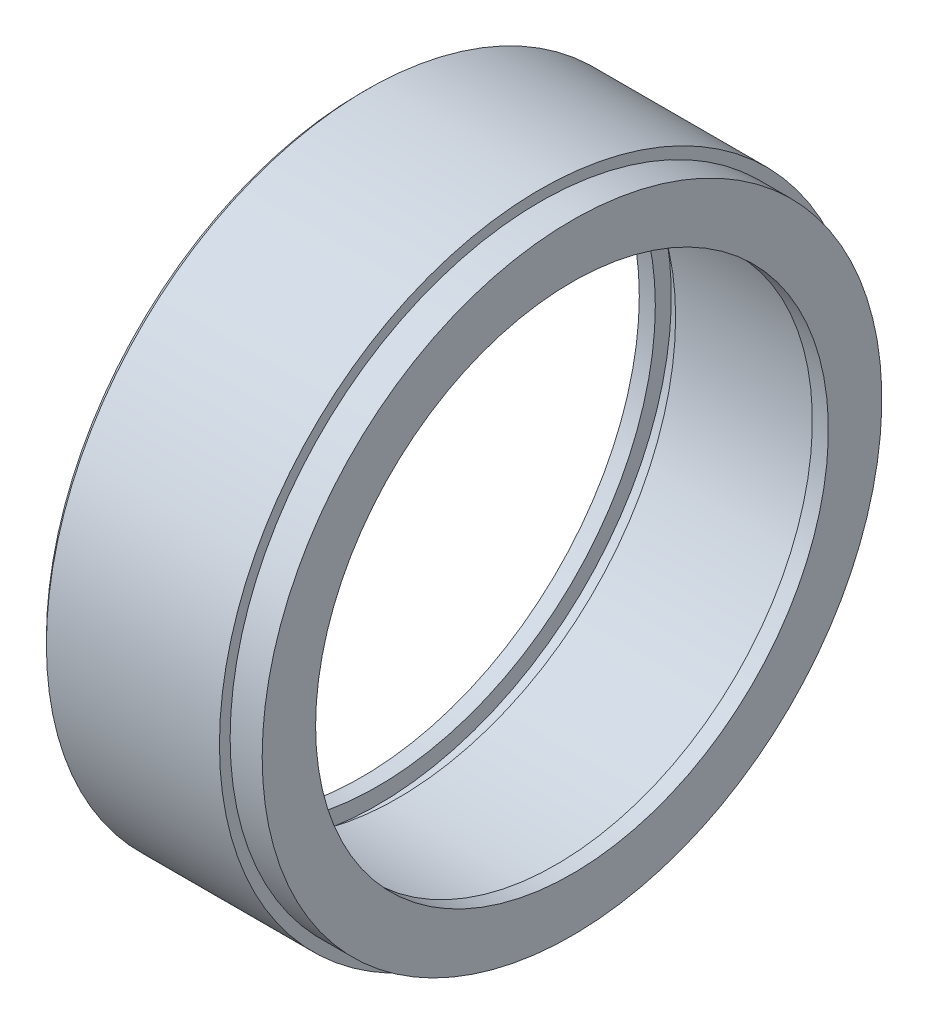
ISO-10303-21;
HEADER;
FILE_DESCRIPTION(('STEP AP214'),'2;1');
FILE_NAME('part.step','',(''),(''),'','','');
FILE_SCHEMA(('AUTOMOTIVE_DESIGN { 1 0 10303 214 1 1 1 1 }'));
ENDSEC;
DATA;
#1=APPLICATION_CONTEXT('core data for automotive mechanical design processes');
#2=APPLICATION_PROTOCOL_DEFINITION('international standard','automotive_design',2000,#1);
#3=PRODUCT_CONTEXT('',#1,'mechanical');
#4=PRODUCT('Part','Part','',(#3));
#5=PRODUCT_RELATED_PRODUCT_CATEGORY('part','',(#4));
#6=PRODUCT_DEFINITION_FORMATION('','',#4);
#7=PRODUCT_DEFINITION_CONTEXT('part definition',#1,'design');
#8=PRODUCT_DEFINITION('design','',#6,#7);
#9=PRODUCT_DEFINITION_SHAPE('','',#8);
#10=(LENGTH_UNIT() NAMED_UNIT(*) SI_UNIT(.MILLI.,.METRE.));
#11=(NAMED_UNIT(*) PLANE_ANGLE_UNIT() SI_UNIT($,.RADIAN.));
#12=(NAMED_UNIT(*) SI_UNIT($,.STERADIAN.) SOLID_ANGLE_UNIT());
#13=UNCERTAINTY_MEASURE_WITH_UNIT(LENGTH_MEASURE(1.E-05),#10,'distance_accuracy_value','');
#14=(GEOMETRIC_REPRESENTATION_CONTEXT(3) GLOBAL_UNCERTAINTY_ASSIGNED_CONTEXT((#13)) GLOBAL_UNIT_ASSIGNED_CONTEXT((#10,
#11,#12)) REPRESENTATION_CONTEXT('',''));
#15=CARTESIAN_POINT('',(0.,0.,0.));
#16=DIRECTION('',(0.,0.,1.));
#17=DIRECTION('',(1.,0.,0.));
#18=AXIS2_PLACEMENT_3D('',#15,#16,#17);
#19=CARTESIAN_POINT('',(0.,29.,0.));
#20=DIRECTION('',(-1.,0.,0.));
#21=DIRECTION('',(0.,0.,1.));
#22=AXIS2_PLACEMENT_3D('',#19,#20,#21);
#23=PLANE('',#22);
#24=CARTESIAN_POINT('',(0.,0.,0.));
#25=DIRECTION('',(-1.,0.,0.));
#26=DIRECTION('',(0.,0.,1.));
#27=AXIS2_PLACEMENT_3D('',#24,#25,#26);
#28=CIRCLE('',#27,29.);
#29=CARTESIAN_POINT('',(0.,0.,29.));
#30=VERTEX_POINT('',#29);
#31=EDGE_CURVE('E77',#30,#30,#28,.T.);
#32=ORIENTED_EDGE('',*,*,#31,.F.);
#33=EDGE_LOOP('',(#32));
#34=FACE_BOUND('',#33,.T.);
#35=CARTESIAN_POINT('',(0.,0.,0.));
#36=DIRECTION('',(-1.,0.,0.));
#37=DIRECTION('',(0.,0.,1.));
#38=AXIS2_PLACEMENT_3D('',#35,#36,#37);
#39=CIRCLE('',#38,24.);
#40=CARTESIAN_POINT('',(0.,0.,24.));
#41=VERTEX_POINT('',#40);
#42=EDGE_CURVE('E44',#41,#41,#39,.T.);
#43=ORIENTED_EDGE('',*,*,#42,.T.);
#44=EDGE_LOOP('',(#43));
#45=FACE_BOUND('',#44,.T.);
#46=ADVANCED_FACE('F33',(#34,#45),#23,.F.);
#47=CARTESIAN_POINT('',(-1000.,0.,0.));
#48=DIRECTION('',(-1.,0.,0.));
#49=DIRECTION('',(0.,0.,1.));
#50=AXIS2_PLACEMENT_3D('',#47,#48,#49);
#51=CYLINDRICAL_SURFACE('',#50,24.);
#52=ORIENTED_EDGE('',*,*,#42,.F.);
#53=EDGE_LOOP('',(#52));
#54=FACE_BOUND('',#53,.T.);
#55=CARTESIAN_POINT('',(-1.49999999999995,0.,0.));
#56=DIRECTION('',(-1.,0.,0.));
#57=DIRECTION('',(0.,0.,1.));
#58=AXIS2_PLACEMENT_3D('',#55,#56,#57);
#59=CIRCLE('',#58,24.);
#60=CARTESIAN_POINT('',(-1.49999999999995,0.,24.));
#61=VERTEX_POINT('',#60);
#62=EDGE_CURVE('E48',#61,#61,#59,.T.);
#63=ORIENTED_EDGE('',*,*,#62,.T.);
#64=EDGE_LOOP('',(#63));
#65=FACE_BOUND('',#64,.T.);
#66=ADVANCED_FACE('F85',(#54,#65),#51,.F.);
#67=CARTESIAN_POINT('',(-1.5,24.,0.));
#68=DIRECTION('',(1.,0.,0.));
#69=DIRECTION('',(0.,0.,-1.));
#70=AXIS2_PLACEMENT_3D('',#67,#68,#69);
#71=PLANE('',#70);
#72=ORIENTED_EDGE('',*,*,#62,.F.);
#73=EDGE_LOOP('',(#72));
#74=FACE_BOUND('',#73,.T.);
#75=CARTESIAN_POINT('',(-1.49999999999995,0.,0.));
#76=DIRECTION('',(-1.,0.,0.));
#77=DIRECTION('',(0.,0.,1.));
#78=AXIS2_PLACEMENT_3D('',#75,#76,#77);
#79=CIRCLE('',#78,26.);
#80=CARTESIAN_POINT('',(-1.49999999999995,0.,26.));
#81=VERTEX_POINT('',#80);
#82=EDGE_CURVE('E53',#81,#81,#79,.T.);
#83=ORIENTED_EDGE('',*,*,#82,.T.);
#84=EDGE_LOOP('',(#83));
#85=FACE_BOUND('',#84,.T.);
#86=ADVANCED_FACE('F90',(#74,#85),#71,.F.);
#87=CARTESIAN_POINT('',(-1000.,0.,0.));
#88=DIRECTION('',(-1.,0.,0.));
#89=DIRECTION('',(0.,0.,1.));
#90=AXIS2_PLACEMENT_3D('',#87,#88,#89);
#91=CYLINDRICAL_SURFACE('',#90,26.);
#92=ORIENTED_EDGE('',*,*,#82,.F.);
#93=EDGE_LOOP('',(#92));
#94=FACE_BOUND('',#93,.T.);
#95=CARTESIAN_POINT('',(-16.3,0.,0.));
#96=DIRECTION('',(-1.,0.,0.));
#97=DIRECTION('',(0.,0.,1.));
#98=AXIS2_PLACEMENT_3D('',#95,#96,#97);
#99=CIRCLE('',#98,26.);
#100=CARTESIAN_POINT('',(-16.3,0.,26.));
#101=VERTEX_POINT('',#100);
#102=EDGE_CURVE('E56',#101,#101,#99,.T.);
#103=ORIENTED_EDGE('',*,*,#102,.T.);
#104=EDGE_LOOP('',(#103));
#105=FACE_BOUND('',#104,.T.);
#106=ADVANCED_FACE('F96',(#94,#105),#91,.F.);
#107=CARTESIAN_POINT('',(-16.3,26.,0.));
#108=DIRECTION('',(1.,0.,0.));
#109=DIRECTION('',(0.,0.,-1.));
#110=AXIS2_PLACEMENT_3D('',#107,#108,#109);
#111=PLANE('',#110);
#112=ORIENTED_EDGE('',*,*,#102,.F.);
#113=EDGE_LOOP('',(#112));
#114=FACE_BOUND('',#113,.T.);
#115=CARTESIAN_POINT('',(-16.3,0.,0.));
#116=DIRECTION('',(-1.,0.,0.));
#117=DIRECTION('',(0.,0.,1.));
#118=AXIS2_PLACEMENT_3D('',#115,#116,#117);
#119=CIRCLE('',#118,27.5);
#120=CARTESIAN_POINT('',(-16.3,0.,27.5));
#121=VERTEX_POINT('',#120);
#122=EDGE_CURVE('E59',#121,#121,#119,.T.);
#123=ORIENTED_EDGE('',*,*,#122,.T.);
#124=EDGE_LOOP('',(#123));
#125=FACE_BOUND('',#124,.T.);
#126=ADVANCED_FACE('F102',(#114,#125),#111,.F.);
#127=CARTESIAN_POINT('',(-1000.,0.,0.));
#128=DIRECTION('',(-1.,0.,0.));
#129=DIRECTION('',(0.,0.,1.));
#130=AXIS2_PLACEMENT_3D('',#127,#128,#129);
#131=CYLINDRICAL_SURFACE('',#130,27.5);
#132=ORIENTED_EDGE('',*,*,#122,.F.);
#133=EDGE_LOOP('',(#132));
#134=FACE_BOUND('',#133,.T.);
#135=CARTESIAN_POINT('',(-18.2,0.,0.));
#136=DIRECTION('',(-1.,0.,0.));
#137=DIRECTION('',(0.,0.,1.));
#138=AXIS2_PLACEMENT_3D('',#135,#136,#137);
#139=CIRCLE('',#138,27.5);
#140=CARTESIAN_POINT('',(-18.2,0.,27.5));
#141=VERTEX_POINT('',#140);
#142=EDGE_CURVE('E62',#141,#141,#139,.T.);
#143=ORIENTED_EDGE('',*,*,#142,.T.);
#144=EDGE_LOOP('',(#143));
#145=FACE_BOUND('',#144,.T.);
#146=ADVANCED_FACE('F108',(#134,#145),#131,.F.);
#147=CARTESIAN_POINT('',(-18.2,26.,0.));
#148=DIRECTION('',(-1.,0.,0.));
#149=DIRECTION('',(0.,0.,1.));
#150=AXIS2_PLACEMENT_3D('',#147,#148,#149);
#151=PLANE('',#150);
#152=ORIENTED_EDGE('',*,*,#142,.F.);
#153=EDGE_LOOP('',(#152));
#154=FACE_BOUND('',#153,.T.);
#155=CARTESIAN_POINT('',(-18.2,0.,0.));
#156=DIRECTION('',(-1.,0.,0.));
#157=DIRECTION('',(0.,0.,1.));
#158=AXIS2_PLACEMENT_3D('',#155,#156,#157);
#159=CIRCLE('',#158,26.);
#160=CARTESIAN_POINT('',(-18.2,0.,26.));
#161=VERTEX_POINT('',#160);
#162=EDGE_CURVE('E65',#161,#161,#159,.T.);
#163=ORIENTED_EDGE('',*,*,#162,.T.);
#164=EDGE_LOOP('',(#163));
#165=FACE_BOUND('',#164,.T.);
#166=ADVANCED_FACE('F114',(#154,#165),#151,.F.);
#167=CARTESIAN_POINT('',(-1000.,0.,0.));
#168=DIRECTION('',(-1.,0.,0.));
#169=DIRECTION('',(0.,0.,1.));
#170=AXIS2_PLACEMENT_3D('',#167,#168,#169);
#171=CYLINDRICAL_SURFACE('',#170,26.);
#172=ORIENTED_EDGE('',*,*,#162,.F.);
#173=EDGE_LOOP('',(#172));
#174=FACE_BOUND('',#173,.T.);
#175=CARTESIAN_POINT('',(-19.7000000000001,0.,0.));
#176=DIRECTION('',(-1.,0.,0.));
#177=DIRECTION('',(0.,0.,1.));
#178=AXIS2_PLACEMENT_3D('',#175,#176,#177);
#179=CIRCLE('',#178,26.);
#180=CARTESIAN_POINT('',(-19.7000000000001,0.,26.));
#181=VERTEX_POINT('',#180);
#182=EDGE_CURVE('E68',#181,#181,#179,.T.);
#183=ORIENTED_EDGE('',*,*,#182,.T.);
#184=EDGE_LOOP('',(#183));
#185=FACE_BOUND('',#184,.T.);
#186=ADVANCED_FACE('F120',(#174,#185),#171,.F.);
#187=CARTESIAN_POINT('',(-19.7,26.,0.));
#188=DIRECTION('',(1.,0.,0.));
#189=DIRECTION('',(0.,0.,-1.));
#190=AXIS2_PLACEMENT_3D('',#187,#188,#189);
#191=PLANE('',#190);
#192=CARTESIAN_POINT('',(-19.7,0.,0.));
#193=DIRECTION('',(1.,0.,0.));
#194=DIRECTION('',(0.,0.,-1.));
#195=AXIS2_PLACEMENT_3D('',#192,#193,#194);
#196=CIRCLE('',#195,29.4999999999998);
#197=CARTESIAN_POINT('',(-19.7,0.,-29.4999999999998));
#198=VERTEX_POINT('',#197);
#199=EDGE_CURVE('E40',#198,#198,#196,.F.);
#200=ORIENTED_EDGE('',*,*,#199,.T.);
#201=EDGE_LOOP('',(#200));
#202=FACE_BOUND('',#201,.T.);
#203=ORIENTED_EDGE('',*,*,#182,.F.);
#204=EDGE_LOOP('',(#203));
#205=FACE_BOUND('',#204,.T.);
#206=ADVANCED_FACE('F126',(#202,#205),#191,.F.);
#207=CARTESIAN_POINT('',(-1000.,0.,0.));
#208=DIRECTION('',(-1.,0.,0.));
#209=DIRECTION('',(0.,0.,1.));
#210=AXIS2_PLACEMENT_3D('',#207,#208,#209);
#211=CYLINDRICAL_SURFACE('',#210,29.9999999999997);
#212=CARTESIAN_POINT('',(-19.2,0.,0.));
#213=DIRECTION('',(1.,0.,0.));
#214=DIRECTION('',(0.,0.,-1.));
#215=AXIS2_PLACEMENT_3D('',#212,#213,#214);
#216=CIRCLE('',#215,29.9999999999997);
#217=CARTESIAN_POINT('',(-19.2,0.,-29.9999999999997));
#218=VERTEX_POINT('',#217);
#219=EDGE_CURVE('E10',#218,#218,#216,.T.);
#220=ORIENTED_EDGE('',*,*,#219,.T.);
#221=EDGE_LOOP('',(#220));
#222=FACE_BOUND('',#221,.T.);
#223=CARTESIAN_POINT('',(-3.,0.,0.));
#224=DIRECTION('',(-1.,0.,0.));
#225=DIRECTION('',(0.,0.,1.));
#226=AXIS2_PLACEMENT_3D('',#223,#224,#225);
#227=CIRCLE('',#226,30.);
#228=CARTESIAN_POINT('',(-3.,0.,30.));
#229=VERTEX_POINT('',#228);
#230=EDGE_CURVE('E71',#229,#229,#227,.T.);
#231=ORIENTED_EDGE('',*,*,#230,.T.);
#232=EDGE_LOOP('',(#231));
#233=FACE_BOUND('',#232,.T.);
#234=ADVANCED_FACE('F131',(#222,#233),#211,.T.);
#235=CARTESIAN_POINT('',(-3.,30.,0.));
#236=DIRECTION('',(-1.,0.,0.));
#237=DIRECTION('',(0.,0.,1.));
#238=AXIS2_PLACEMENT_3D('',#235,#236,#237);
#239=PLANE('',#238);
#240=ORIENTED_EDGE('',*,*,#230,.F.);
#241=EDGE_LOOP('',(#240));
#242=FACE_BOUND('',#241,.T.);
#243=CARTESIAN_POINT('',(-3.,0.,0.));
#244=DIRECTION('',(-1.,0.,0.));
#245=DIRECTION('',(0.,0.,1.));
#246=AXIS2_PLACEMENT_3D('',#243,#244,#245);
#247=CIRCLE('',#246,29.);
#248=CARTESIAN_POINT('',(-3.,0.,29.));
#249=VERTEX_POINT('',#248);
#250=EDGE_CURVE('E74',#249,#249,#247,.T.);
#251=ORIENTED_EDGE('',*,*,#250,.T.);
#252=EDGE_LOOP('',(#251));
#253=FACE_BOUND('',#252,.T.);
#254=ADVANCED_FACE('F136',(#242,#253),#239,.F.);
#255=CARTESIAN_POINT('',(-1000.,0.,0.));
#256=DIRECTION('',(-1.,0.,0.));
#257=DIRECTION('',(0.,0.,1.));
#258=AXIS2_PLACEMENT_3D('',#255,#256,#257);
#259=CYLINDRICAL_SURFACE('',#258,29.);
#260=ORIENTED_EDGE('',*,*,#250,.F.);
#261=EDGE_LOOP('',(#260));
#262=FACE_BOUND('',#261,.T.);
#263=ORIENTED_EDGE('',*,*,#31,.T.);
#264=EDGE_LOOP('',(#263));
#265=FACE_BOUND('',#264,.T.);
#266=ADVANCED_FACE('F81',(#262,#265),#259,.T.);
#267=CARTESIAN_POINT('',(-19.7000000000001,0.,0.));
#268=DIRECTION('',(1.,0.,0.));
#269=DIRECTION('',(0.,0.,-1.));
#270=AXIS2_PLACEMENT_3D('',#267,#268,#269);
#271=CONICAL_SURFACE('',#270,29.4999999999997,0.785398163397396);
#272=ORIENTED_EDGE('',*,*,#219,.F.);
#273=EDGE_LOOP('',(#272));
#274=FACE_BOUND('',#273,.T.);
#275=ORIENTED_EDGE('',*,*,#199,.F.);
#276=EDGE_LOOP('',(#275));
#277=FACE_BOUND('',#276,.T.);
#278=ADVANCED_FACE('F35',(#274,#277),#271,.T.);
#279=CLOSED_SHELL('',(#46,#66,#86,#106,#126,#146,#166,#186,#206,#234,#254,#266,#278));
#280=MANIFOLD_SOLID_BREP('B2',#279);
#281=ADVANCED_BREP_SHAPE_REPRESENTATION('',(#18,#280),#14);
#282=SHAPE_DEFINITION_REPRESENTATION(#9,#281);
ENDSEC;
END-ISO-10303-21;
